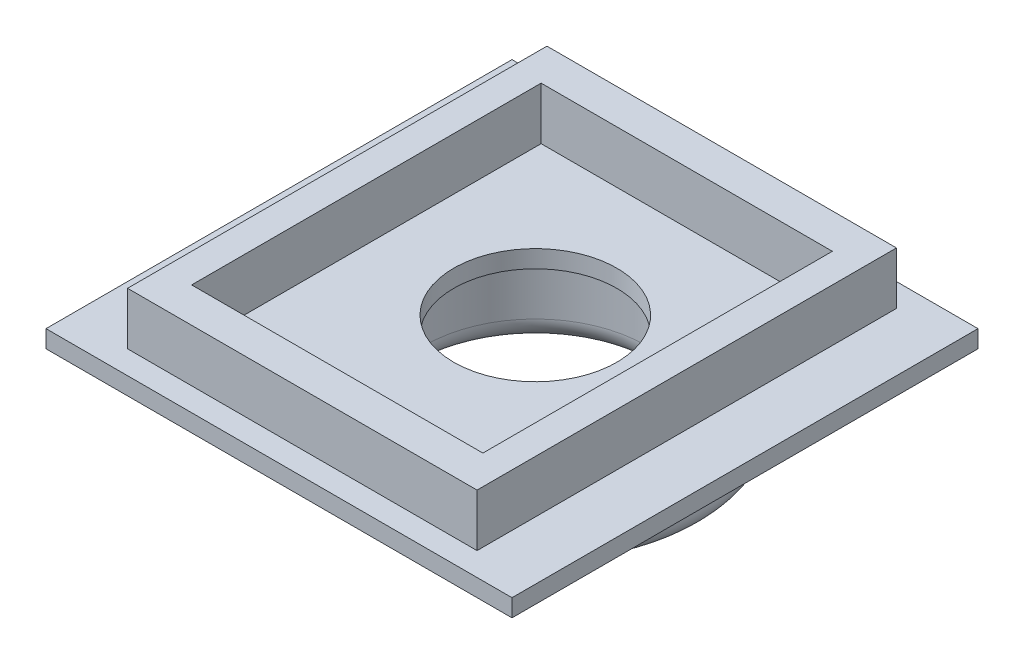
ISO-10303-21;
HEADER;
FILE_DESCRIPTION(('STEP AP214'),'2;1');
FILE_NAME('part.step','',(''),(''),'','','');
FILE_SCHEMA(('AUTOMOTIVE_DESIGN { 1 0 10303 214 1 1 1 1 }'));
ENDSEC;
DATA;
#1=APPLICATION_CONTEXT('core data for automotive mechanical design processes');
#2=APPLICATION_PROTOCOL_DEFINITION('international standard','automotive_design',2000,#1);
#3=PRODUCT_CONTEXT('',#1,'mechanical');
#4=PRODUCT('Part','Part','',(#3));
#5=PRODUCT_RELATED_PRODUCT_CATEGORY('part','',(#4));
#6=PRODUCT_DEFINITION_FORMATION('','',#4);
#7=PRODUCT_DEFINITION_CONTEXT('part definition',#1,'design');
#8=PRODUCT_DEFINITION('design','',#6,#7);
#9=PRODUCT_DEFINITION_SHAPE('','',#8);
#10=(LENGTH_UNIT() NAMED_UNIT(*) SI_UNIT(.MILLI.,.METRE.));
#11=(NAMED_UNIT(*) PLANE_ANGLE_UNIT() SI_UNIT($,.RADIAN.));
#12=(NAMED_UNIT(*) SI_UNIT($,.STERADIAN.) SOLID_ANGLE_UNIT());
#13=UNCERTAINTY_MEASURE_WITH_UNIT(LENGTH_MEASURE(1.E-05),#10,'distance_accuracy_value','');
#14=(GEOMETRIC_REPRESENTATION_CONTEXT(3) GLOBAL_UNCERTAINTY_ASSIGNED_CONTEXT((#13)) GLOBAL_UNIT_ASSIGNED_CONTEXT((#10,
#11,#12)) REPRESENTATION_CONTEXT('',''));
#15=CARTESIAN_POINT('',(0.,0.,0.));
#16=DIRECTION('',(0.,0.,1.));
#17=DIRECTION('',(1.,0.,0.));
#18=AXIS2_PLACEMENT_3D('',#15,#16,#17);
#19=CARTESIAN_POINT('',(0.,0.,0.));
#20=DIRECTION('',(0.,-1.,0.));
#21=DIRECTION('',(0.,0.,-1.));
#22=AXIS2_PLACEMENT_3D('',#19,#20,#21);
#23=PLANE('',#22);
#24=CARTESIAN_POINT('',(0.,0.,-2.));
#25=DIRECTION('',(0.,1.,0.));
#26=DIRECTION('',(0.,0.,1.));
#27=AXIS2_PLACEMENT_3D('',#24,#25,#26);
#28=CIRCLE('',#27,7.);
#29=CARTESIAN_POINT('',(0.,0.,5.));
#30=VERTEX_POINT('',#29);
#31=EDGE_CURVE('E226',#30,#30,#28,.T.);
#32=ORIENTED_EDGE('',*,*,#31,.T.);
#33=EDGE_LOOP('',(#32));
#34=FACE_BOUND('',#33,.T.);
#35=CARTESIAN_POINT('',(0.,0.,-2.));
#36=DIRECTION('',(0.,-1.,0.));
#37=DIRECTION('',(0.,0.,-1.));
#38=AXIS2_PLACEMENT_3D('',#35,#36,#37);
#39=CIRCLE('',#38,9.5);
#40=CARTESIAN_POINT('',(0.,0.,-11.5));
#41=VERTEX_POINT('',#40);
#42=EDGE_CURVE('E169',#41,#41,#39,.T.);
#43=ORIENTED_EDGE('',*,*,#42,.T.);
#44=EDGE_LOOP('',(#43));
#45=FACE_BOUND('',#44,.T.);
#46=ADVANCED_FACE('F41',(#34,#45),#23,.T.);
#47=CARTESIAN_POINT('',(0.,1.5,0.));
#48=DIRECTION('',(0.,-1.,0.));
#49=DIRECTION('',(0.,0.,-1.));
#50=AXIS2_PLACEMENT_3D('',#47,#48,#49);
#51=PLANE('',#50);
#52=DIRECTION('',(0.,0.,-1.));
#53=VECTOR('',#52,1.);
#54=CARTESIAN_POINT('',(20.,1.5,20.));
#55=LINE('',#54,#53);
#56=CARTESIAN_POINT('',(20.,1.5,20.));
#57=VERTEX_POINT('',#56);
#58=CARTESIAN_POINT('',(20.,1.5,-20.));
#59=VERTEX_POINT('',#58);
#60=EDGE_CURVE('E234',#57,#59,#55,.T.);
#61=ORIENTED_EDGE('',*,*,#60,.T.);
#62=DIRECTION('',(-1.,0.,0.));
#63=VECTOR('',#62,1.);
#64=CARTESIAN_POINT('',(-20.,1.5,-20.));
#65=LINE('',#64,#63);
#66=CARTESIAN_POINT('',(-20.,1.5,-20.));
#67=VERTEX_POINT('',#66);
#68=EDGE_CURVE('E238',#59,#67,#65,.T.);
#69=ORIENTED_EDGE('',*,*,#68,.T.);
#70=DIRECTION('',(0.,0.,1.));
#71=VECTOR('',#70,1.);
#72=CARTESIAN_POINT('',(-20.,1.5,20.));
#73=LINE('',#72,#71);
#74=CARTESIAN_POINT('',(-20.,1.5,20.));
#75=VERTEX_POINT('',#74);
#76=EDGE_CURVE('E242',#67,#75,#73,.T.);
#77=ORIENTED_EDGE('',*,*,#76,.T.);
#78=DIRECTION('',(1.,0.,0.));
#79=VECTOR('',#78,1.);
#80=CARTESIAN_POINT('',(-20.,1.5,20.));
#81=LINE('',#80,#79);
#82=EDGE_CURVE('E245',#75,#57,#81,.T.);
#83=ORIENTED_EDGE('',*,*,#82,.T.);
#84=EDGE_LOOP('',(#61,#69,#77,#83));
#85=FACE_BOUND('',#84,.T.);
#86=DIRECTION('',(0.,0.,-1.));
#87=VECTOR('',#86,1.);
#88=CARTESIAN_POINT('',(15.,1.5,18.));
#89=LINE('',#88,#87);
#90=CARTESIAN_POINT('',(15.,1.5,18.));
#91=VERTEX_POINT('',#90);
#92=CARTESIAN_POINT('',(15.,1.5,-18.));
#93=VERTEX_POINT('',#92);
#94=EDGE_CURVE('E150',#91,#93,#89,.T.);
#95=ORIENTED_EDGE('',*,*,#94,.F.);
#96=DIRECTION('',(1.,0.,0.));
#97=VECTOR('',#96,1.);
#98=CARTESIAN_POINT('',(-15.,1.5,18.));
#99=LINE('',#98,#97);
#100=CARTESIAN_POINT('',(-15.,1.5,18.));
#101=VERTEX_POINT('',#100);
#102=EDGE_CURVE('E191',#101,#91,#99,.T.);
#103=ORIENTED_EDGE('',*,*,#102,.F.);
#104=DIRECTION('',(0.,0.,1.));
#105=VECTOR('',#104,1.);
#106=CARTESIAN_POINT('',(-15.,1.5,18.));
#107=LINE('',#106,#105);
#108=CARTESIAN_POINT('',(-15.,1.5,-18.));
#109=VERTEX_POINT('',#108);
#110=EDGE_CURVE('E62',#109,#101,#107,.T.);
#111=ORIENTED_EDGE('',*,*,#110,.F.);
#112=DIRECTION('',(-1.,0.,0.));
#113=VECTOR('',#112,1.);
#114=CARTESIAN_POINT('',(-15.,1.5,-18.));
#115=LINE('',#114,#113);
#116=EDGE_CURVE('E57',#93,#109,#115,.T.);
#117=ORIENTED_EDGE('',*,*,#116,.F.);
#118=EDGE_LOOP('',(#95,#103,#111,#117));
#119=FACE_BOUND('',#118,.T.);
#120=ADVANCED_FACE('F335',(#85,#119),#51,.F.);
#121=CARTESIAN_POINT('',(20.,1.5,20.));
#122=DIRECTION('',(-1.,0.,0.));
#123=DIRECTION('',(0.,0.,1.));
#124=AXIS2_PLACEMENT_3D('',#121,#122,#123);
#125=PLANE('',#124);
#126=DIRECTION('',(0.,0.,-1.));
#127=VECTOR('',#126,1.);
#128=CARTESIAN_POINT('',(20.,0.,20.));
#129=LINE('',#128,#127);
#130=CARTESIAN_POINT('',(20.,0.,20.));
#131=VERTEX_POINT('',#130);
#132=CARTESIAN_POINT('',(20.,0.,-20.));
#133=VERTEX_POINT('',#132);
#134=EDGE_CURVE('E230',#131,#133,#129,.T.);
#135=ORIENTED_EDGE('',*,*,#134,.T.);
#136=DIRECTION('',(0.,-1.,0.));
#137=VECTOR('',#136,1.);
#138=CARTESIAN_POINT('',(20.,1.5,-20.));
#139=LINE('',#138,#137);
#140=EDGE_CURVE('E271',#59,#133,#139,.T.);
#141=ORIENTED_EDGE('',*,*,#140,.F.);
#142=ORIENTED_EDGE('',*,*,#60,.F.);
#143=DIRECTION('',(0.,-1.,0.));
#144=VECTOR('',#143,1.);
#145=CARTESIAN_POINT('',(20.,1.5,20.));
#146=LINE('',#145,#144);
#147=EDGE_CURVE('E248',#57,#131,#146,.T.);
#148=ORIENTED_EDGE('',*,*,#147,.T.);
#149=EDGE_LOOP('',(#135,#141,#142,#148));
#150=FACE_BOUND('',#149,.T.);
#151=ADVANCED_FACE('F321',(#150),#125,.F.);
#152=CARTESIAN_POINT('',(-20.,1.5,-20.));
#153=DIRECTION('',(0.,0.,1.));
#154=DIRECTION('',(1.,0.,0.));
#155=AXIS2_PLACEMENT_3D('',#152,#153,#154);
#156=PLANE('',#155);
#157=DIRECTION('',(-1.,0.,0.));
#158=VECTOR('',#157,1.);
#159=CARTESIAN_POINT('',(-20.,0.,-20.));
#160=LINE('',#159,#158);
#161=CARTESIAN_POINT('',(-20.,0.,-20.));
#162=VERTEX_POINT('',#161);
#163=EDGE_CURVE('E252',#133,#162,#160,.T.);
#164=ORIENTED_EDGE('',*,*,#163,.T.);
#165=DIRECTION('',(0.,-1.,0.));
#166=VECTOR('',#165,1.);
#167=CARTESIAN_POINT('',(-20.,1.5,-20.));
#168=LINE('',#167,#166);
#169=EDGE_CURVE('E267',#67,#162,#168,.T.);
#170=ORIENTED_EDGE('',*,*,#169,.F.);
#171=ORIENTED_EDGE('',*,*,#68,.F.);
#172=ORIENTED_EDGE('',*,*,#140,.T.);
#173=EDGE_LOOP('',(#164,#170,#171,#172));
#174=FACE_BOUND('',#173,.T.);
#175=ADVANCED_FACE('F333',(#174),#156,.F.);
#176=CARTESIAN_POINT('',(-20.,1.5,20.));
#177=DIRECTION('',(1.,0.,0.));
#178=DIRECTION('',(0.,0.,-1.));
#179=AXIS2_PLACEMENT_3D('',#176,#177,#178);
#180=PLANE('',#179);
#181=DIRECTION('',(0.,0.,1.));
#182=VECTOR('',#181,1.);
#183=CARTESIAN_POINT('',(-20.,0.,20.));
#184=LINE('',#183,#182);
#185=CARTESIAN_POINT('',(-20.,0.,20.));
#186=VERTEX_POINT('',#185);
#187=EDGE_CURVE('E255',#162,#186,#184,.T.);
#188=ORIENTED_EDGE('',*,*,#187,.T.);
#189=DIRECTION('',(0.,-1.,0.));
#190=VECTOR('',#189,1.);
#191=CARTESIAN_POINT('',(-20.,1.5,20.));
#192=LINE('',#191,#190);
#193=EDGE_CURVE('E263',#75,#186,#192,.T.);
#194=ORIENTED_EDGE('',*,*,#193,.F.);
#195=ORIENTED_EDGE('',*,*,#76,.F.);
#196=ORIENTED_EDGE('',*,*,#169,.T.);
#197=EDGE_LOOP('',(#188,#194,#195,#196));
#198=FACE_BOUND('',#197,.T.);
#199=ADVANCED_FACE('F330',(#198),#180,.F.);
#200=CARTESIAN_POINT('',(-20.,1.5,20.));
#201=DIRECTION('',(0.,0.,-1.));
#202=DIRECTION('',(-1.,0.,0.));
#203=AXIS2_PLACEMENT_3D('',#200,#201,#202);
#204=PLANE('',#203);
#205=DIRECTION('',(1.,0.,0.));
#206=VECTOR('',#205,1.);
#207=CARTESIAN_POINT('',(-20.,0.,20.));
#208=LINE('',#207,#206);
#209=EDGE_CURVE('E239',#186,#131,#208,.T.);
#210=ORIENTED_EDGE('',*,*,#209,.T.);
#211=ORIENTED_EDGE('',*,*,#147,.F.);
#212=ORIENTED_EDGE('',*,*,#82,.F.);
#213=ORIENTED_EDGE('',*,*,#193,.T.);
#214=EDGE_LOOP('',(#210,#211,#212,#213));
#215=FACE_BOUND('',#214,.T.);
#216=ADVANCED_FACE('F326',(#215),#204,.F.);
#217=DIRECTION('',(1.,0.,0.));
#218=VECTOR('',#217,1.);
#219=CARTESIAN_POINT('',(-12.5,1.5,15.));
#220=LINE('',#219,#218);
#221=CARTESIAN_POINT('',(-12.5,1.5,15.));
#222=VERTEX_POINT('',#221);
#223=CARTESIAN_POINT('',(12.5,1.5,15.));
#224=VERTEX_POINT('',#223);
#225=EDGE_CURVE('E142',#222,#224,#220,.T.);
#226=ORIENTED_EDGE('',*,*,#225,.T.);
#227=DIRECTION('',(0.,0.,-1.));
#228=VECTOR('',#227,1.);
#229=CARTESIAN_POINT('',(12.5,1.5,15.));
#230=LINE('',#229,#228);
#231=CARTESIAN_POINT('',(12.5,1.5,-15.));
#232=VERTEX_POINT('',#231);
#233=EDGE_CURVE('E166',#224,#232,#230,.T.);
#234=ORIENTED_EDGE('',*,*,#233,.T.);
#235=DIRECTION('',(-1.,0.,0.));
#236=VECTOR('',#235,1.);
#237=CARTESIAN_POINT('',(-12.5,1.5,-15.));
#238=LINE('',#237,#236);
#239=CARTESIAN_POINT('',(-12.5,1.5,-15.));
#240=VERTEX_POINT('',#239);
#241=EDGE_CURVE('E148',#232,#240,#238,.T.);
#242=ORIENTED_EDGE('',*,*,#241,.T.);
#243=DIRECTION('',(0.,0.,1.));
#244=VECTOR('',#243,1.);
#245=CARTESIAN_POINT('',(-12.5,1.5,15.));
#246=LINE('',#245,#244);
#247=EDGE_CURVE('E172',#240,#222,#246,.T.);
#248=ORIENTED_EDGE('',*,*,#247,.T.);
#249=EDGE_LOOP('',(#226,#234,#242,#248));
#250=FACE_BOUND('',#249,.T.);
#251=CARTESIAN_POINT('',(0.,1.5,-2.));
#252=DIRECTION('',(0.,1.,0.));
#253=DIRECTION('',(0.,0.,1.));
#254=AXIS2_PLACEMENT_3D('',#251,#252,#253);
#255=CIRCLE('',#254,7.);
#256=CARTESIAN_POINT('',(0.,1.5,5.));
#257=VERTEX_POINT('',#256);
#258=EDGE_CURVE('E225',#257,#257,#255,.T.);
#259=ORIENTED_EDGE('',*,*,#258,.F.);
#260=EDGE_LOOP('',(#259));
#261=FACE_BOUND('',#260,.T.);
#262=ADVANCED_FACE('F314',(#250,#261),#51,.F.);
#263=CARTESIAN_POINT('',(0.,0.,-2.));
#264=DIRECTION('',(0.,-1.,0.));
#265=DIRECTION('',(0.,0.,-1.));
#266=AXIS2_PLACEMENT_3D('',#263,#264,#265);
#267=CIRCLE('',#266,14.5);
#268=CARTESIAN_POINT('',(0.,0.,-16.5));
#269=VERTEX_POINT('',#268);
#270=EDGE_CURVE('E275',#269,#269,#267,.T.);
#271=ORIENTED_EDGE('',*,*,#270,.F.);
#272=EDGE_LOOP('',(#271));
#273=FACE_BOUND('',#272,.T.);
#274=ORIENTED_EDGE('',*,*,#134,.F.);
#275=ORIENTED_EDGE('',*,*,#209,.F.);
#276=ORIENTED_EDGE('',*,*,#187,.F.);
#277=ORIENTED_EDGE('',*,*,#163,.F.);
#278=EDGE_LOOP('',(#274,#275,#276,#277));
#279=FACE_BOUND('',#278,.T.);
#280=ADVANCED_FACE('F310',(#273,#279),#23,.T.);
#281=CARTESIAN_POINT('',(0.,0.,-2.));
#282=DIRECTION('',(0.,1.,0.));
#283=DIRECTION('',(0.,0.,1.));
#284=AXIS2_PLACEMENT_3D('',#281,#282,#283);
#285=CYLINDRICAL_SURFACE('',#284,7.);
#286=ORIENTED_EDGE('',*,*,#31,.F.);
#287=EDGE_LOOP('',(#286));
#288=FACE_BOUND('',#287,.T.);
#289=ORIENTED_EDGE('',*,*,#258,.T.);
#290=EDGE_LOOP('',(#289));
#291=FACE_BOUND('',#290,.T.);
#292=ADVANCED_FACE('F313',(#288,#291),#285,.F.);
#293=CARTESIAN_POINT('',(0.,6.,0.));
#294=DIRECTION('',(0.,-1.,0.));
#295=DIRECTION('',(0.,0.,-1.));
#296=AXIS2_PLACEMENT_3D('',#293,#294,#295);
#297=PLANE('',#296);
#298=DIRECTION('',(0.,0.,-1.));
#299=VECTOR('',#298,1.);
#300=CARTESIAN_POINT('',(15.,6.,18.));
#301=LINE('',#300,#299);
#302=CARTESIAN_POINT('',(15.,6.,18.));
#303=VERTEX_POINT('',#302);
#304=CARTESIAN_POINT('',(15.,6.,-18.));
#305=VERTEX_POINT('',#304);
#306=EDGE_CURVE('E186',#303,#305,#301,.T.);
#307=ORIENTED_EDGE('',*,*,#306,.T.);
#308=DIRECTION('',(-1.,0.,0.));
#309=VECTOR('',#308,1.);
#310=CARTESIAN_POINT('',(-15.,6.,-18.));
#311=LINE('',#310,#309);
#312=CARTESIAN_POINT('',(-15.,6.,-18.));
#313=VERTEX_POINT('',#312);
#314=EDGE_CURVE('E190',#305,#313,#311,.T.);
#315=ORIENTED_EDGE('',*,*,#314,.T.);
#316=DIRECTION('',(0.,0.,1.));
#317=VECTOR('',#316,1.);
#318=CARTESIAN_POINT('',(-15.,6.,18.));
#319=LINE('',#318,#317);
#320=CARTESIAN_POINT('',(-15.,6.,18.));
#321=VERTEX_POINT('',#320);
#322=EDGE_CURVE('E194',#313,#321,#319,.T.);
#323=ORIENTED_EDGE('',*,*,#322,.T.);
#324=DIRECTION('',(1.,0.,0.));
#325=VECTOR('',#324,1.);
#326=CARTESIAN_POINT('',(-15.,6.,18.));
#327=LINE('',#326,#325);
#328=EDGE_CURVE('E197',#321,#303,#327,.T.);
#329=ORIENTED_EDGE('',*,*,#328,.T.);
#330=EDGE_LOOP('',(#307,#315,#323,#329));
#331=FACE_BOUND('',#330,.T.);
#332=DIRECTION('',(0.,0.,-1.));
#333=VECTOR('',#332,1.);
#334=CARTESIAN_POINT('',(12.5,6.,15.));
#335=LINE('',#334,#333);
#336=CARTESIAN_POINT('',(12.5,6.,15.));
#337=VERTEX_POINT('',#336);
#338=CARTESIAN_POINT('',(12.5,6.,-15.));
#339=VERTEX_POINT('',#338);
#340=EDGE_CURVE('E130',#337,#339,#335,.T.);
#341=ORIENTED_EDGE('',*,*,#340,.F.);
#342=DIRECTION('',(1.,0.,0.));
#343=VECTOR('',#342,1.);
#344=CARTESIAN_POINT('',(-12.5,6.,15.));
#345=LINE('',#344,#343);
#346=CARTESIAN_POINT('',(-12.5,6.,15.));
#347=VERTEX_POINT('',#346);
#348=EDGE_CURVE('E160',#347,#337,#345,.T.);
#349=ORIENTED_EDGE('',*,*,#348,.F.);
#350=DIRECTION('',(0.,0.,1.));
#351=VECTOR('',#350,1.);
#352=CARTESIAN_POINT('',(-12.5,6.,15.));
#353=LINE('',#352,#351);
#354=CARTESIAN_POINT('',(-12.5,6.,-15.));
#355=VERTEX_POINT('',#354);
#356=EDGE_CURVE('E156',#355,#347,#353,.T.);
#357=ORIENTED_EDGE('',*,*,#356,.F.);
#358=DIRECTION('',(-1.,0.,0.));
#359=VECTOR('',#358,1.);
#360=CARTESIAN_POINT('',(-12.5,6.,-15.));
#361=LINE('',#360,#359);
#362=EDGE_CURVE('E141',#339,#355,#361,.T.);
#363=ORIENTED_EDGE('',*,*,#362,.F.);
#364=EDGE_LOOP('',(#341,#349,#357,#363));
#365=FACE_BOUND('',#364,.T.);
#366=ADVANCED_FACE('F154',(#331,#365),#297,.F.);
#367=CARTESIAN_POINT('',(15.,6.,18.));
#368=DIRECTION('',(-1.,0.,0.));
#369=DIRECTION('',(0.,0.,1.));
#370=AXIS2_PLACEMENT_3D('',#367,#368,#369);
#371=PLANE('',#370);
#372=ORIENTED_EDGE('',*,*,#94,.T.);
#373=DIRECTION('',(0.,-1.,0.));
#374=VECTOR('',#373,1.);
#375=CARTESIAN_POINT('',(15.,6.,-18.));
#376=LINE('',#375,#374);
#377=EDGE_CURVE('E222',#305,#93,#376,.T.);
#378=ORIENTED_EDGE('',*,*,#377,.F.);
#379=ORIENTED_EDGE('',*,*,#306,.F.);
#380=DIRECTION('',(0.,-1.,0.));
#381=VECTOR('',#380,1.);
#382=CARTESIAN_POINT('',(15.,6.,18.));
#383=LINE('',#382,#381);
#384=EDGE_CURVE('E200',#303,#91,#383,.T.);
#385=ORIENTED_EDGE('',*,*,#384,.T.);
#386=EDGE_LOOP('',(#372,#378,#379,#385));
#387=FACE_BOUND('',#386,.T.);
#388=ADVANCED_FACE('F346',(#387),#371,.F.);
#389=CARTESIAN_POINT('',(-15.,6.,-18.));
#390=DIRECTION('',(0.,0.,1.));
#391=DIRECTION('',(1.,0.,0.));
#392=AXIS2_PLACEMENT_3D('',#389,#390,#391);
#393=PLANE('',#392);
#394=ORIENTED_EDGE('',*,*,#116,.T.);
#395=DIRECTION('',(0.,-1.,0.));
#396=VECTOR('',#395,1.);
#397=CARTESIAN_POINT('',(-15.,6.,-18.));
#398=LINE('',#397,#396);
#399=EDGE_CURVE('E218',#313,#109,#398,.T.);
#400=ORIENTED_EDGE('',*,*,#399,.F.);
#401=ORIENTED_EDGE('',*,*,#314,.F.);
#402=ORIENTED_EDGE('',*,*,#377,.T.);
#403=EDGE_LOOP('',(#394,#400,#401,#402));
#404=FACE_BOUND('',#403,.T.);
#405=ADVANCED_FACE('F353',(#404),#393,.F.);
#406=CARTESIAN_POINT('',(-15.,6.,18.));
#407=DIRECTION('',(1.,0.,0.));
#408=DIRECTION('',(0.,0.,-1.));
#409=AXIS2_PLACEMENT_3D('',#406,#407,#408);
#410=PLANE('',#409);
#411=ORIENTED_EDGE('',*,*,#110,.T.);
#412=DIRECTION('',(0.,-1.,0.));
#413=VECTOR('',#412,1.);
#414=CARTESIAN_POINT('',(-15.,6.,18.));
#415=LINE('',#414,#413);
#416=EDGE_CURVE('E214',#321,#101,#415,.T.);
#417=ORIENTED_EDGE('',*,*,#416,.F.);
#418=ORIENTED_EDGE('',*,*,#322,.F.);
#419=ORIENTED_EDGE('',*,*,#399,.T.);
#420=EDGE_LOOP('',(#411,#417,#418,#419));
#421=FACE_BOUND('',#420,.T.);
#422=ADVANCED_FACE('F351',(#421),#410,.F.);
#423=CARTESIAN_POINT('',(-15.,6.,18.));
#424=DIRECTION('',(0.,0.,-1.));
#425=DIRECTION('',(-1.,0.,0.));
#426=AXIS2_PLACEMENT_3D('',#423,#424,#425);
#427=PLANE('',#426);
#428=ORIENTED_EDGE('',*,*,#102,.T.);
#429=ORIENTED_EDGE('',*,*,#384,.F.);
#430=ORIENTED_EDGE('',*,*,#328,.F.);
#431=ORIENTED_EDGE('',*,*,#416,.T.);
#432=EDGE_LOOP('',(#428,#429,#430,#431));
#433=FACE_BOUND('',#432,.T.);
#434=ADVANCED_FACE('F342',(#433),#427,.F.);
#435=CARTESIAN_POINT('',(12.5,6.,15.));
#436=DIRECTION('',(-1.,0.,0.));
#437=DIRECTION('',(0.,0.,1.));
#438=AXIS2_PLACEMENT_3D('',#435,#436,#437);
#439=PLANE('',#438);
#440=ORIENTED_EDGE('',*,*,#233,.F.);
#441=DIRECTION('',(0.,-1.,0.));
#442=VECTOR('',#441,1.);
#443=CARTESIAN_POINT('',(12.5,6.,15.));
#444=LINE('',#443,#442);
#445=EDGE_CURVE('E136',#337,#224,#444,.T.);
#446=ORIENTED_EDGE('',*,*,#445,.F.);
#447=ORIENTED_EDGE('',*,*,#340,.T.);
#448=DIRECTION('',(0.,-1.,0.));
#449=VECTOR('',#448,1.);
#450=CARTESIAN_POINT('',(12.5,6.,-15.));
#451=LINE('',#450,#449);
#452=EDGE_CURVE('E134',#339,#232,#451,.T.);
#453=ORIENTED_EDGE('',*,*,#452,.T.);
#454=EDGE_LOOP('',(#440,#446,#447,#453));
#455=FACE_BOUND('',#454,.T.);
#456=ADVANCED_FACE('F133',(#455),#439,.T.);
#457=CARTESIAN_POINT('',(-12.5,6.,-15.));
#458=DIRECTION('',(0.,0.,1.));
#459=DIRECTION('',(1.,0.,0.));
#460=AXIS2_PLACEMENT_3D('',#457,#458,#459);
#461=PLANE('',#460);
#462=ORIENTED_EDGE('',*,*,#241,.F.);
#463=ORIENTED_EDGE('',*,*,#452,.F.);
#464=ORIENTED_EDGE('',*,*,#362,.T.);
#465=DIRECTION('',(0.,-1.,0.));
#466=VECTOR('',#465,1.);
#467=CARTESIAN_POINT('',(-12.5,6.,-15.));
#468=LINE('',#467,#466);
#469=EDGE_CURVE('E151',#355,#240,#468,.T.);
#470=ORIENTED_EDGE('',*,*,#469,.T.);
#471=EDGE_LOOP('',(#462,#463,#464,#470));
#472=FACE_BOUND('',#471,.T.);
#473=ADVANCED_FACE('F145',(#472),#461,.T.);
#474=CARTESIAN_POINT('',(-12.5,6.,15.));
#475=DIRECTION('',(1.,0.,0.));
#476=DIRECTION('',(0.,0.,-1.));
#477=AXIS2_PLACEMENT_3D('',#474,#475,#476);
#478=PLANE('',#477);
#479=ORIENTED_EDGE('',*,*,#247,.F.);
#480=ORIENTED_EDGE('',*,*,#469,.F.);
#481=ORIENTED_EDGE('',*,*,#356,.T.);
#482=DIRECTION('',(0.,-1.,0.));
#483=VECTOR('',#482,1.);
#484=CARTESIAN_POINT('',(-12.5,6.,15.));
#485=LINE('',#484,#483);
#486=EDGE_CURVE('E181',#347,#222,#485,.T.);
#487=ORIENTED_EDGE('',*,*,#486,.T.);
#488=EDGE_LOOP('',(#479,#480,#481,#487));
#489=FACE_BOUND('',#488,.T.);
#490=ADVANCED_FACE('F453',(#489),#478,.T.);
#491=CARTESIAN_POINT('',(-12.5,6.,15.));
#492=DIRECTION('',(0.,0.,-1.));
#493=DIRECTION('',(-1.,0.,0.));
#494=AXIS2_PLACEMENT_3D('',#491,#492,#493);
#495=PLANE('',#494);
#496=ORIENTED_EDGE('',*,*,#225,.F.);
#497=ORIENTED_EDGE('',*,*,#486,.F.);
#498=ORIENTED_EDGE('',*,*,#348,.T.);
#499=ORIENTED_EDGE('',*,*,#445,.T.);
#500=EDGE_LOOP('',(#496,#497,#498,#499));
#501=FACE_BOUND('',#500,.T.);
#502=ADVANCED_FACE('F462',(#501),#495,.T.);
#503=CARTESIAN_POINT('',(0.,-7.5,-2.));
#504=DIRECTION('',(0.,-1.,0.));
#505=DIRECTION('',(0.,0.,-1.));
#506=AXIS2_PLACEMENT_3D('',#503,#504,#505);
#507=PLANE('',#506);
#508=CARTESIAN_POINT('',(0.,-7.5,-2.));
#509=DIRECTION('',(0.,-1.,0.));
#510=DIRECTION('',(0.,0.,-1.));
#511=AXIS2_PLACEMENT_3D('',#508,#509,#510);
#512=CIRCLE('',#511,11.5);
#513=CARTESIAN_POINT('',(0.,-7.5,-13.5));
#514=VERTEX_POINT('',#513);
#515=EDGE_CURVE('E50',#514,#514,#512,.F.);
#516=ORIENTED_EDGE('',*,*,#515,.T.);
#517=EDGE_LOOP('',(#516));
#518=FACE_BOUND('',#517,.T.);
#519=CARTESIAN_POINT('',(0.,-7.5,-2.));
#520=DIRECTION('',(0.,-1.,0.));
#521=DIRECTION('',(0.,0.,-1.));
#522=AXIS2_PLACEMENT_3D('',#519,#520,#521);
#523=CIRCLE('',#522,12.5);
#524=CARTESIAN_POINT('',(0.,-7.5,-14.5));
#525=VERTEX_POINT('',#524);
#526=EDGE_CURVE('E280',#525,#525,#523,.T.);
#527=ORIENTED_EDGE('',*,*,#526,.T.);
#528=EDGE_LOOP('',(#527));
#529=FACE_BOUND('',#528,.T.);
#530=ADVANCED_FACE('F287',(#518,#529),#507,.T.);
#531=CARTESIAN_POINT('',(0.,-7.5,-2.));
#532=DIRECTION('',(0.,1.,0.));
#533=DIRECTION('',(0.,0.,1.));
#534=AXIS2_PLACEMENT_3D('',#531,#532,#533);
#535=CYLINDRICAL_SURFACE('',#534,14.5);
#536=CARTESIAN_POINT('',(0.,-5.5,-2.));
#537=DIRECTION('',(0.,-1.,0.));
#538=DIRECTION('',(0.,0.,-1.));
#539=AXIS2_PLACEMENT_3D('',#536,#537,#538);
#540=CIRCLE('',#539,14.5);
#541=CARTESIAN_POINT('',(0.,-5.5,-16.5));
#542=VERTEX_POINT('',#541);
#543=EDGE_CURVE('E11',#542,#542,#540,.F.);
#544=ORIENTED_EDGE('',*,*,#543,.T.);
#545=EDGE_LOOP('',(#544));
#546=FACE_BOUND('',#545,.T.);
#547=ORIENTED_EDGE('',*,*,#270,.T.);
#548=EDGE_LOOP('',(#547));
#549=FACE_BOUND('',#548,.T.);
#550=ADVANCED_FACE('F298',(#546,#549),#535,.T.);
#551=CARTESIAN_POINT('',(0.,-7.5,-2.));
#552=DIRECTION('',(0.,1.,0.));
#553=DIRECTION('',(0.,0.,1.));
#554=AXIS2_PLACEMENT_3D('',#551,#552,#553);
#555=CYLINDRICAL_SURFACE('',#554,9.5);
#556=CARTESIAN_POINT('',(0.,-5.5,-2.));
#557=DIRECTION('',(0.,-1.,0.));
#558=DIRECTION('',(0.,0.,-1.));
#559=AXIS2_PLACEMENT_3D('',#556,#557,#558);
#560=CIRCLE('',#559,9.5);
#561=CARTESIAN_POINT('',(0.,-5.5,-11.5));
#562=VERTEX_POINT('',#561);
#563=EDGE_CURVE('E276',#562,#562,#560,.T.);
#564=ORIENTED_EDGE('',*,*,#563,.T.);
#565=EDGE_LOOP('',(#564));
#566=FACE_BOUND('',#565,.T.);
#567=ORIENTED_EDGE('',*,*,#42,.F.);
#568=EDGE_LOOP('',(#567));
#569=FACE_BOUND('',#568,.T.);
#570=ADVANCED_FACE('F293',(#566,#569),#555,.F.);
#571=CARTESIAN_POINT('',(0.,-5.5,-2.));
#572=DIRECTION('',(0.,-1.,0.));
#573=DIRECTION('',(0.,0.,-1.));
#574=AXIS2_PLACEMENT_3D('',#571,#572,#573);
#575=TOROIDAL_SURFACE('',#574,11.5,2.);
#576=ORIENTED_EDGE('',*,*,#515,.F.);
#577=EDGE_LOOP('',(#576));
#578=FACE_BOUND('',#577,.T.);
#579=ORIENTED_EDGE('',*,*,#563,.F.);
#580=EDGE_LOOP('',(#579));
#581=FACE_BOUND('',#580,.T.);
#582=ADVANCED_FACE('F290',(#578,#581),#575,.T.);
#583=CARTESIAN_POINT('',(0.,-5.5,-2.));
#584=DIRECTION('',(0.,-1.,0.));
#585=DIRECTION('',(0.,0.,-1.));
#586=AXIS2_PLACEMENT_3D('',#583,#584,#585);
#587=TOROIDAL_SURFACE('',#586,12.5,2.);
#588=ORIENTED_EDGE('',*,*,#543,.F.);
#589=EDGE_LOOP('',(#588));
#590=FACE_BOUND('',#589,.T.);
#591=ORIENTED_EDGE('',*,*,#526,.F.);
#592=EDGE_LOOP('',(#591));
#593=FACE_BOUND('',#592,.T.);
#594=ADVANCED_FACE('F43',(#590,#593),#587,.T.);
#595=CLOSED_SHELL('',(#46,#120,#151,#175,#199,#216,#262,#280,#292,#366,#388,#405,#422,#434,#456,
#473,#490,#502,#530,#550,#570,#582,#594));
#596=MANIFOLD_SOLID_BREP('B2',#595);
#597=ADVANCED_BREP_SHAPE_REPRESENTATION('',(#18,#596),#14);
#598=SHAPE_DEFINITION_REPRESENTATION(#9,#597);
ENDSEC;
END-ISO-10303-21;
